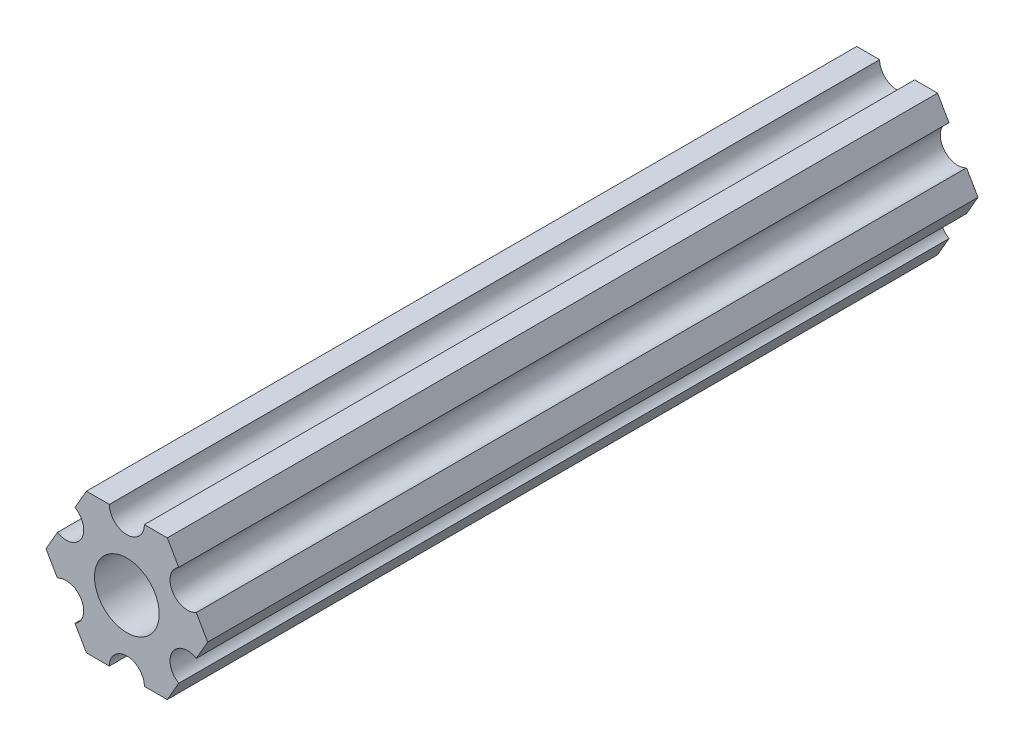
ISO-10303-21;
HEADER;
FILE_DESCRIPTION(('STEP AP214'),'2;1');
FILE_NAME('part.step','',(''),(''),'','','');
FILE_SCHEMA(('AUTOMOTIVE_DESIGN { 1 0 10303 214 1 1 1 1 }'));
ENDSEC;
DATA;
#1=APPLICATION_CONTEXT('core data for automotive mechanical design processes');
#2=APPLICATION_PROTOCOL_DEFINITION('international standard','automotive_design',2000,#1);
#3=PRODUCT_CONTEXT('',#1,'mechanical');
#4=PRODUCT('Part','Part','',(#3));
#5=PRODUCT_RELATED_PRODUCT_CATEGORY('part','',(#4));
#6=PRODUCT_DEFINITION_FORMATION('','',#4);
#7=PRODUCT_DEFINITION_CONTEXT('part definition',#1,'design');
#8=PRODUCT_DEFINITION('design','',#6,#7);
#9=PRODUCT_DEFINITION_SHAPE('','',#8);
#10=(LENGTH_UNIT() NAMED_UNIT(*) SI_UNIT(.MILLI.,.METRE.));
#11=(NAMED_UNIT(*) PLANE_ANGLE_UNIT() SI_UNIT($,.RADIAN.));
#12=(NAMED_UNIT(*) SI_UNIT($,.STERADIAN.) SOLID_ANGLE_UNIT());
#13=UNCERTAINTY_MEASURE_WITH_UNIT(LENGTH_MEASURE(1.E-05),#10,'distance_accuracy_value','');
#14=(GEOMETRIC_REPRESENTATION_CONTEXT(3) GLOBAL_UNCERTAINTY_ASSIGNED_CONTEXT((#13)) GLOBAL_UNIT_ASSIGNED_CONTEXT((#10,
#11,#12)) REPRESENTATION_CONTEXT('',''));
#15=CARTESIAN_POINT('',(0.,0.,0.));
#16=DIRECTION('',(0.,0.,1.));
#17=DIRECTION('',(1.,0.,0.));
#18=AXIS2_PLACEMENT_3D('',#15,#16,#17);
#19=CARTESIAN_POINT('',(6.29301142309098,-1.80018429024546,69.85));
#20=DIRECTION('',(-0.866025434075723,0.499999947533953,0.));
#21=DIRECTION('',(-0.499999947533953,-0.866025434075723,0.));
#22=AXIS2_PLACEMENT_3D('',#19,#20,#21);
#23=PLANE('',#22);
#24=DIRECTION('',(0.,0.,1.));
#25=VECTOR('',#24,1.);
#26=CARTESIAN_POINT('',(7.33234841870826,4.44212519169686E-07,69.85));
#27=LINE('',#26,#25);
#28=CARTESIAN_POINT('',(7.33234841870826,4.44212518961143E-07,0.));
#29=VERTEX_POINT('',#28);
#30=CARTESIAN_POINT('',(7.33234841870826,4.44212519315656E-07,69.85));
#31=VERTEX_POINT('',#30);
#32=EDGE_CURVE('E298',#29,#31,#27,.T.);
#33=ORIENTED_EDGE('',*,*,#32,.T.);
#34=DIRECTION('',(0.499999947533953,0.866025434075723,0.));
#35=VECTOR('',#34,1.);
#36=CARTESIAN_POINT('',(6.29301142309098,-1.80018429024546,69.85));
#37=LINE('',#36,#35);
#38=CARTESIAN_POINT('',(6.29301142309098,-1.80018429024546,69.85));
#39=VERTEX_POINT('',#38);
#40=EDGE_CURVE('E181',#39,#31,#37,.T.);
#41=ORIENTED_EDGE('',*,*,#40,.F.);
#42=DIRECTION('',(0.,0.,-1.));
#43=VECTOR('',#42,1.);
#44=CARTESIAN_POINT('',(6.29301142309098,-1.80018429024546,69.85));
#45=LINE('',#44,#43);
#46=CARTESIAN_POINT('',(6.29301142309098,-1.80018429024546,0.));
#47=VERTEX_POINT('',#46);
#48=EDGE_CURVE('E247',#39,#47,#45,.T.);
#49=ORIENTED_EDGE('',*,*,#48,.T.);
#50=DIRECTION('',(0.499999947533953,0.866025434075723,0.));
#51=VECTOR('',#50,1.);
#52=CARTESIAN_POINT('',(6.29301142309098,-1.80018429024546,0.));
#53=LINE('',#52,#51);
#54=EDGE_CURVE('E185',#47,#29,#53,.T.);
#55=ORIENTED_EDGE('',*,*,#54,.T.);
#56=EDGE_LOOP('',(#33,#41,#49,#55));
#57=FACE_BOUND('',#56,.T.);
#58=ADVANCED_FACE('F16',(#57),#23,.F.);
#59=CARTESIAN_POINT('',(7.33234841870826,4.44212519169686E-07,69.85));
#60=DIRECTION('',(-0.866025373493145,-0.500000052466056,0.));
#61=DIRECTION('',(0.500000052466056,-0.866025373493145,0.));
#62=AXIS2_PLACEMENT_3D('',#59,#60,#61);
#63=PLANE('',#62);
#64=DIRECTION('',(0.,0.,-1.));
#65=VECTOR('',#64,1.);
#66=CARTESIAN_POINT('',(6.29301120497139,1.80018505273895,69.85));
#67=LINE('',#66,#65);
#68=CARTESIAN_POINT('',(6.29301120497139,1.80018505273895,0.));
#69=VERTEX_POINT('',#68);
#70=CARTESIAN_POINT('',(6.29301120497139,1.80018505273895,69.85));
#71=VERTEX_POINT('',#70);
#72=EDGE_CURVE('E296',#69,#71,#67,.F.);
#73=ORIENTED_EDGE('',*,*,#72,.T.);
#74=DIRECTION('',(-0.500000052466056,0.866025373493145,0.));
#75=VECTOR('',#74,1.);
#76=CARTESIAN_POINT('',(7.33234841870826,4.44212519198905E-07,69.85));
#77=LINE('',#76,#75);
#78=EDGE_CURVE('E63',#31,#71,#77,.T.);
#79=ORIENTED_EDGE('',*,*,#78,.F.);
#80=ORIENTED_EDGE('',*,*,#32,.F.);
#81=DIRECTION('',(-0.500000052466056,0.866025373493145,0.));
#82=VECTOR('',#81,1.);
#83=CARTESIAN_POINT('',(7.33234841870826,4.44212519198905E-07,0.));
#84=LINE('',#83,#82);
#85=EDGE_CURVE('E244',#29,#69,#84,.T.);
#86=ORIENTED_EDGE('',*,*,#85,.T.);
#87=EDGE_LOOP('',(#73,#79,#80,#86));
#88=FACE_BOUND('',#87,.T.);
#89=ADVANCED_FACE('F345',(#88),#63,.F.);
#90=CARTESIAN_POINT('',(5.49926112168156,3.17500033315933,69.85));
#91=DIRECTION('',(0.,0.,-1.));
#92=DIRECTION('',(-1.,0.,0.));
#93=AXIS2_PLACEMENT_3D('',#90,#91,#92);
#94=CYLINDRICAL_SURFACE('',#93,1.5875);
#95=CARTESIAN_POINT('',(5.49926112168156,3.17500033315933,69.85));
#96=DIRECTION('',(0.,0.,-1.));
#97=DIRECTION('',(-1.,0.,0.));
#98=AXIS2_PLACEMENT_3D('',#95,#96,#97);
#99=CIRCLE('',#98,1.5875);
#100=CARTESIAN_POINT('',(4.70551103839172,4.54981561357972,69.85));
#101=VERTEX_POINT('',#100);
#102=EDGE_CURVE('E55',#71,#101,#99,.T.);
#103=ORIENTED_EDGE('',*,*,#102,.F.);
#104=ORIENTED_EDGE('',*,*,#72,.F.);
#105=CARTESIAN_POINT('',(5.49926112168156,3.17500033315933,0.));
#106=DIRECTION('',(0.,0.,-1.));
#107=DIRECTION('',(-1.,0.,0.));
#108=AXIS2_PLACEMENT_3D('',#105,#106,#107);
#109=CIRCLE('',#108,1.5875);
#110=CARTESIAN_POINT('',(4.70551103839172,4.54981561357972,0.));
#111=VERTEX_POINT('',#110);
#112=EDGE_CURVE('E19',#69,#111,#109,.T.);
#113=ORIENTED_EDGE('',*,*,#112,.T.);
#114=DIRECTION('',(0.,0.,1.));
#115=VECTOR('',#114,1.);
#116=CARTESIAN_POINT('',(4.70551103839172,4.54981561357972,69.85));
#117=LINE('',#116,#115);
#118=EDGE_CURVE('E292',#111,#101,#117,.T.);
#119=ORIENTED_EDGE('',*,*,#118,.T.);
#120=EDGE_LOOP('',(#103,#104,#113,#119));
#121=FACE_BOUND('',#120,.T.);
#122=ADVANCED_FACE('F343',(#121),#94,.F.);
#123=CARTESIAN_POINT('',(4.70551103839172,4.54981561357972,69.85));
#124=DIRECTION('',(-0.866025373493151,-0.500000052466046,0.));
#125=DIRECTION('',(0.500000052466046,-0.866025373493151,0.));
#126=AXIS2_PLACEMENT_3D('',#123,#124,#125);
#127=PLANE('',#126);
#128=DIRECTION('',(0.,0.,1.));
#129=VECTOR('',#128,1.);
#130=CARTESIAN_POINT('',(3.66617382465481,6.35000022210627,69.85));
#131=LINE('',#130,#129);
#132=CARTESIAN_POINT('',(3.66617382465481,6.35000022210627,0.));
#133=VERTEX_POINT('',#132);
#134=CARTESIAN_POINT('',(3.66617382465481,6.35000022210627,69.85));
#135=VERTEX_POINT('',#134);
#136=EDGE_CURVE('E289',#133,#135,#131,.T.);
#137=ORIENTED_EDGE('',*,*,#136,.T.);
#138=DIRECTION('',(-0.500000052466046,0.866025373493151,0.));
#139=VECTOR('',#138,1.);
#140=CARTESIAN_POINT('',(4.70551103839172,4.54981561357972,69.85));
#141=LINE('',#140,#139);
#142=EDGE_CURVE('E174',#101,#135,#141,.T.);
#143=ORIENTED_EDGE('',*,*,#142,.F.);
#144=ORIENTED_EDGE('',*,*,#118,.F.);
#145=DIRECTION('',(-0.500000052466046,0.866025373493151,0.));
#146=VECTOR('',#145,1.);
#147=CARTESIAN_POINT('',(4.70551103839172,4.54981561357972,0.));
#148=LINE('',#147,#146);
#149=EDGE_CURVE('E237',#111,#133,#148,.T.);
#150=ORIENTED_EDGE('',*,*,#149,.T.);
#151=EDGE_LOOP('',(#137,#143,#144,#150));
#152=FACE_BOUND('',#151,.T.);
#153=ADVANCED_FACE('F336',(#152),#127,.F.);
#154=CARTESIAN_POINT('',(3.66617382465481,6.35000022210627,69.85));
#155=DIRECTION('',(6.05825850611185E-08,-0.999999999999998,0.));
#156=DIRECTION('',(0.999999999999998,6.05825850611185E-08,0.));
#157=AXIS2_PLACEMENT_3D('',#154,#155,#156);
#158=PLANE('',#157);
#159=DIRECTION('',(0.,0.,-1.));
#160=VECTOR('',#159,1.);
#161=CARTESIAN_POINT('',(1.58749961530074,6.35000009617482,69.85));
#162=LINE('',#161,#160);
#163=CARTESIAN_POINT('',(1.58749961530073,6.35000015914054,0.));
#164=VERTEX_POINT('',#163);
#165=CARTESIAN_POINT('',(1.58749961530073,6.35000015914054,69.85));
#166=VERTEX_POINT('',#165);
#167=EDGE_CURVE('E287',#164,#166,#162,.F.);
#168=ORIENTED_EDGE('',*,*,#167,.T.);
#169=DIRECTION('',(1.,0.,0.));
#170=VECTOR('',#169,1.);
#171=CARTESIAN_POINT('',(5.49926112168156,6.35000022210627,69.85));
#172=LINE('',#171,#170);
#173=EDGE_CURVE('E144',#135,#166,#172,.F.);
#174=ORIENTED_EDGE('',*,*,#173,.F.);
#175=ORIENTED_EDGE('',*,*,#136,.F.);
#176=DIRECTION('',(1.,0.,0.));
#177=VECTOR('',#176,1.);
#178=CARTESIAN_POINT('',(5.49926112168156,6.35000022210627,0.));
#179=LINE('',#178,#177);
#180=EDGE_CURVE('E234',#133,#164,#179,.F.);
#181=ORIENTED_EDGE('',*,*,#180,.T.);
#182=EDGE_LOOP('',(#168,#174,#175,#181));
#183=FACE_BOUND('',#182,.T.);
#184=ADVANCED_FACE('F333',(#183),#158,.F.);
#185=CARTESIAN_POINT('',(-3.84699260060323E-07,6.35,69.85));
#186=DIRECTION('',(0.,0.,-1.));
#187=DIRECTION('',(-1.,0.,0.));
#188=AXIS2_PLACEMENT_3D('',#185,#186,#187);
#189=CYLINDRICAL_SURFACE('',#188,1.5875);
#190=DIRECTION('',(0.,0.,1.));
#191=VECTOR('',#190,1.);
#192=CARTESIAN_POINT('',(-1.58750038469926,6.34999990382518,69.85));
#193=LINE('',#192,#191);
#194=CARTESIAN_POINT('',(-1.58750038469926,6.34999990382518,0.));
#195=VERTEX_POINT('',#194);
#196=CARTESIAN_POINT('',(-1.58750038469926,6.34999990382518,69.85));
#197=VERTEX_POINT('',#196);
#198=EDGE_CURVE('E103',#195,#197,#193,.T.);
#199=ORIENTED_EDGE('',*,*,#198,.T.);
#200=CARTESIAN_POINT('',(-3.84699260060323E-07,6.35,69.85));
#201=DIRECTION('',(0.,0.,-1.));
#202=DIRECTION('',(-1.,0.,0.));
#203=AXIS2_PLACEMENT_3D('',#200,#201,#202);
#204=CIRCLE('',#203,1.5875);
#205=EDGE_CURVE('E148',#166,#197,#204,.T.);
#206=ORIENTED_EDGE('',*,*,#205,.F.);
#207=ORIENTED_EDGE('',*,*,#167,.F.);
#208=CARTESIAN_POINT('',(-3.84699260060323E-07,6.35,0.));
#209=DIRECTION('',(0.,0.,-1.));
#210=DIRECTION('',(-1.,0.,0.));
#211=AXIS2_PLACEMENT_3D('',#208,#209,#210);
#212=CIRCLE('',#211,1.5875);
#213=EDGE_CURVE('E231',#164,#195,#212,.T.);
#214=ORIENTED_EDGE('',*,*,#213,.T.);
#215=EDGE_LOOP('',(#199,#206,#207,#214));
#216=FACE_BOUND('',#215,.T.);
#217=ADVANCED_FACE('F327',(#216),#189,.F.);
#218=CARTESIAN_POINT('',(-1.58750038469926,6.34999990382518,69.85));
#219=DIRECTION('',(6.05825963273174E-08,-0.999999999999998,0.));
#220=DIRECTION('',(0.999999999999998,6.05825963273174E-08,0.));
#221=AXIS2_PLACEMENT_3D('',#218,#219,#220);
#222=PLANE('',#221);
#223=DIRECTION('',(0.,0.,1.));
#224=VECTOR('',#223,1.);
#225=CARTESIAN_POINT('',(-3.66617459405349,6.3499997778937,69.85));
#226=LINE('',#225,#224);
#227=CARTESIAN_POINT('',(-3.66617454558244,6.34999986184803,0.));
#228=VERTEX_POINT('',#227);
#229=CARTESIAN_POINT('',(-3.66617454558244,6.34999986184803,69.85));
#230=VERTEX_POINT('',#229);
#231=EDGE_CURVE('E111',#228,#230,#226,.T.);
#232=ORIENTED_EDGE('',*,*,#231,.T.);
#233=DIRECTION('',(1.,0.,0.));
#234=VECTOR('',#233,1.);
#235=CARTESIAN_POINT('',(5.49926112168156,6.34999990382518,69.85));
#236=LINE('',#235,#234);
#237=EDGE_CURVE('E149',#197,#230,#236,.F.);
#238=ORIENTED_EDGE('',*,*,#237,.F.);
#239=ORIENTED_EDGE('',*,*,#198,.F.);
#240=DIRECTION('',(1.,0.,0.));
#241=VECTOR('',#240,1.);
#242=CARTESIAN_POINT('',(5.49926112168156,6.34999990382518,0.));
#243=LINE('',#242,#241);
#244=EDGE_CURVE('E156',#195,#228,#243,.F.);
#245=ORIENTED_EDGE('',*,*,#244,.T.);
#246=EDGE_LOOP('',(#232,#238,#239,#245));
#247=FACE_BOUND('',#246,.T.);
#248=ADVANCED_FACE('F155',(#247),#222,.F.);
#249=CARTESIAN_POINT('',(-3.66617459405349,6.3499997778937,69.85));
#250=DIRECTION('',(0.866025434075729,-0.499999947533942,0.));
#251=DIRECTION('',(0.499999947533942,0.866025434075729,0.));
#252=AXIS2_PLACEMENT_3D('',#249,#250,#251);
#253=PLANE('',#252);
#254=DIRECTION('',(0.,0.,-1.));
#255=VECTOR('',#254,1.);
#256=CARTESIAN_POINT('',(-4.70551158967065,4.54981504343587,69.85));
#257=LINE('',#256,#255);
#258=CARTESIAN_POINT('',(-4.70551158967065,4.54981504343587,0.));
#259=VERTEX_POINT('',#258);
#260=CARTESIAN_POINT('',(-4.70551158967065,4.54981504343587,69.85));
#261=VERTEX_POINT('',#260);
#262=EDGE_CURVE('E157',#259,#261,#257,.F.);
#263=ORIENTED_EDGE('',*,*,#262,.T.);
#264=DIRECTION('',(-0.499999947533943,-0.866025434075729,0.));
#265=VECTOR('',#264,1.);
#266=CARTESIAN_POINT('',(-3.66617459405349,6.3499997778937,69.85));
#267=LINE('',#266,#265);
#268=EDGE_CURVE('E152',#230,#261,#267,.T.);
#269=ORIENTED_EDGE('',*,*,#268,.F.);
#270=ORIENTED_EDGE('',*,*,#231,.F.);
#271=DIRECTION('',(-0.499999947533943,-0.866025434075729,0.));
#272=VECTOR('',#271,1.);
#273=CARTESIAN_POINT('',(-3.66617459405349,6.3499997778937,0.));
#274=LINE('',#273,#272);
#275=EDGE_CURVE('E226',#228,#259,#274,.T.);
#276=ORIENTED_EDGE('',*,*,#275,.T.);
#277=EDGE_LOOP('',(#263,#269,#270,#276));
#278=FACE_BOUND('',#277,.T.);
#279=ADVANCED_FACE('F159',(#278),#253,.F.);
#280=CARTESIAN_POINT('',(-5.49926150638082,3.17499966684067,69.85));
#281=DIRECTION('',(0.,0.,-1.));
#282=DIRECTION('',(-1.,0.,0.));
#283=AXIS2_PLACEMENT_3D('',#280,#281,#282);
#284=CYLINDRICAL_SURFACE('',#283,1.5875);
#285=DIRECTION('',(0.,0.,1.));
#286=VECTOR('',#285,1.);
#287=CARTESIAN_POINT('',(-6.29301142309098,1.80018429024547,69.85));
#288=LINE('',#287,#286);
#289=CARTESIAN_POINT('',(-6.29301142309098,1.80018429024547,0.));
#290=VERTEX_POINT('',#289);
#291=CARTESIAN_POINT('',(-6.29301142309098,1.80018429024547,69.85));
#292=VERTEX_POINT('',#291);
#293=EDGE_CURVE('E278',#290,#292,#288,.T.);
#294=ORIENTED_EDGE('',*,*,#293,.T.);
#295=CARTESIAN_POINT('',(-5.49926150638082,3.17499966684067,69.85));
#296=DIRECTION('',(0.,0.,-1.));
#297=DIRECTION('',(-1.,0.,0.));
#298=AXIS2_PLACEMENT_3D('',#295,#296,#297);
#299=CIRCLE('',#298,1.5875);
#300=EDGE_CURVE('E161',#261,#292,#299,.T.);
#301=ORIENTED_EDGE('',*,*,#300,.F.);
#302=ORIENTED_EDGE('',*,*,#262,.F.);
#303=CARTESIAN_POINT('',(-5.49926150638082,3.17499966684067,0.));
#304=DIRECTION('',(0.,0.,-1.));
#305=DIRECTION('',(-1.,0.,0.));
#306=AXIS2_PLACEMENT_3D('',#303,#304,#305);
#307=CIRCLE('',#306,1.5875);
#308=EDGE_CURVE('E223',#259,#290,#307,.T.);
#309=ORIENTED_EDGE('',*,*,#308,.T.);
#310=EDGE_LOOP('',(#294,#301,#302,#309));
#311=FACE_BOUND('',#310,.T.);
#312=ADVANCED_FACE('F408',(#311),#284,.F.);
#313=CARTESIAN_POINT('',(-6.29301142309098,1.80018429024547,69.85));
#314=DIRECTION('',(0.866025434075724,-0.499999947533951,0.));
#315=DIRECTION('',(0.499999947533951,0.866025434075724,0.));
#316=AXIS2_PLACEMENT_3D('',#313,#314,#315);
#317=PLANE('',#316);
#318=DIRECTION('',(0.,0.,1.));
#319=VECTOR('',#318,1.);
#320=CARTESIAN_POINT('',(-7.33234841870826,-4.44212523790841E-07,69.85));
#321=LINE('',#320,#319);
#322=CARTESIAN_POINT('',(-7.33234841870826,-4.44212524036367E-07,0.));
#323=VERTEX_POINT('',#322);
#324=CARTESIAN_POINT('',(-7.33234841870826,-4.44212524036367E-07,69.85));
#325=VERTEX_POINT('',#324);
#326=EDGE_CURVE('E275',#323,#325,#321,.T.);
#327=ORIENTED_EDGE('',*,*,#326,.T.);
#328=DIRECTION('',(-0.499999947533952,-0.866025434075724,0.));
#329=VECTOR('',#328,1.);
#330=CARTESIAN_POINT('',(-6.29301142309098,1.80018429024547,69.85));
#331=LINE('',#330,#329);
#332=EDGE_CURVE('E163',#292,#325,#331,.T.);
#333=ORIENTED_EDGE('',*,*,#332,.F.);
#334=ORIENTED_EDGE('',*,*,#293,.F.);
#335=DIRECTION('',(-0.499999947533952,-0.866025434075724,0.));
#336=VECTOR('',#335,1.);
#337=CARTESIAN_POINT('',(-6.29301142309098,1.80018429024547,0.));
#338=LINE('',#337,#336);
#339=EDGE_CURVE('E218',#290,#323,#338,.T.);
#340=ORIENTED_EDGE('',*,*,#339,.T.);
#341=EDGE_LOOP('',(#327,#333,#334,#340));
#342=FACE_BOUND('',#341,.T.);
#343=ADVANCED_FACE('F376',(#342),#317,.F.);
#344=CARTESIAN_POINT('',(-7.33234841870826,-4.44212523790841E-07,69.85));
#345=DIRECTION('',(0.866025373493151,0.500000052466045,0.));
#346=DIRECTION('',(-0.500000052466045,0.866025373493151,0.));
#347=AXIS2_PLACEMENT_3D('',#344,#345,#346);
#348=PLANE('',#347);
#349=DIRECTION('',(0.,0.,-1.));
#350=VECTOR('',#349,1.);
#351=CARTESIAN_POINT('',(-6.29301120497141,-1.80018505273896,69.85));
#352=LINE('',#351,#350);
#353=CARTESIAN_POINT('',(-6.29301120497141,-1.80018505273896,0.));
#354=VERTEX_POINT('',#353);
#355=CARTESIAN_POINT('',(-6.29301120497141,-1.80018505273896,69.85));
#356=VERTEX_POINT('',#355);
#357=EDGE_CURVE('E272',#354,#356,#352,.F.);
#358=ORIENTED_EDGE('',*,*,#357,.T.);
#359=DIRECTION('',(0.500000052466045,-0.866025373493151,0.));
#360=VECTOR('',#359,1.);
#361=CARTESIAN_POINT('',(-7.33234841870826,-4.44212523969395E-07,69.85));
#362=LINE('',#361,#360);
#363=EDGE_CURVE('E313',#325,#356,#362,.T.);
#364=ORIENTED_EDGE('',*,*,#363,.F.);
#365=ORIENTED_EDGE('',*,*,#326,.F.);
#366=DIRECTION('',(0.500000052466045,-0.866025373493151,0.));
#367=VECTOR('',#366,1.);
#368=CARTESIAN_POINT('',(-7.33234841870826,-4.44212523969395E-07,0.));
#369=LINE('',#368,#367);
#370=EDGE_CURVE('E215',#323,#354,#369,.T.);
#371=ORIENTED_EDGE('',*,*,#370,.T.);
#372=EDGE_LOOP('',(#358,#364,#365,#371));
#373=FACE_BOUND('',#372,.T.);
#374=ADVANCED_FACE('F380',(#373),#348,.F.);
#375=CARTESIAN_POINT('',(-5.49926112168156,-3.17500033315934,69.85));
#376=DIRECTION('',(0.,0.,-1.));
#377=DIRECTION('',(-1.,0.,0.));
#378=AXIS2_PLACEMENT_3D('',#375,#376,#377);
#379=CYLINDRICAL_SURFACE('',#378,1.5875);
#380=DIRECTION('',(0.,0.,1.));
#381=VECTOR('',#380,1.);
#382=CARTESIAN_POINT('',(-4.70551103839172,-4.54981561357972,69.85));
#383=LINE('',#382,#381);
#384=CARTESIAN_POINT('',(-4.70551103839172,-4.54981561357972,0.));
#385=VERTEX_POINT('',#384);
#386=CARTESIAN_POINT('',(-4.70551103839172,-4.54981561357972,69.85));
#387=VERTEX_POINT('',#386);
#388=EDGE_CURVE('E267',#385,#387,#383,.T.);
#389=ORIENTED_EDGE('',*,*,#388,.T.);
#390=CARTESIAN_POINT('',(-5.49926112168156,-3.17500033315934,69.85));
#391=DIRECTION('',(0.,0.,-1.));
#392=DIRECTION('',(-1.,0.,0.));
#393=AXIS2_PLACEMENT_3D('',#390,#391,#392);
#394=CIRCLE('',#393,1.5875);
#395=EDGE_CURVE('E311',#356,#387,#394,.T.);
#396=ORIENTED_EDGE('',*,*,#395,.F.);
#397=ORIENTED_EDGE('',*,*,#357,.F.);
#398=CARTESIAN_POINT('',(-5.49926112168156,-3.17500033315934,0.));
#399=DIRECTION('',(0.,0.,-1.));
#400=DIRECTION('',(-1.,0.,0.));
#401=AXIS2_PLACEMENT_3D('',#398,#399,#400);
#402=CIRCLE('',#401,1.5875);
#403=EDGE_CURVE('E212',#354,#385,#402,.T.);
#404=ORIENTED_EDGE('',*,*,#403,.T.);
#405=EDGE_LOOP('',(#389,#396,#397,#404));
#406=FACE_BOUND('',#405,.T.);
#407=ADVANCED_FACE('F384',(#406),#379,.F.);
#408=CARTESIAN_POINT('',(-4.70551103839172,-4.54981561357972,69.85));
#409=DIRECTION('',(0.866025373493151,0.500000052466045,0.));
#410=DIRECTION('',(-0.500000052466045,0.866025373493151,0.));
#411=AXIS2_PLACEMENT_3D('',#408,#409,#410);
#412=PLANE('',#411);
#413=DIRECTION('',(0.,0.,1.));
#414=VECTOR('',#413,1.);
#415=CARTESIAN_POINT('',(-3.66617382465481,-6.35000022210628,69.85));
#416=LINE('',#415,#414);
#417=CARTESIAN_POINT('',(-3.6661738246548,-6.35000022210628,0.));
#418=VERTEX_POINT('',#417);
#419=CARTESIAN_POINT('',(-3.6661738246548,-6.35000022210628,69.85));
#420=VERTEX_POINT('',#419);
#421=EDGE_CURVE('E264',#418,#420,#416,.T.);
#422=ORIENTED_EDGE('',*,*,#421,.T.);
#423=DIRECTION('',(0.500000052466045,-0.866025373493151,0.));
#424=VECTOR('',#423,1.);
#425=CARTESIAN_POINT('',(-4.70551103839172,-4.54981561357972,69.85));
#426=LINE('',#425,#424);
#427=EDGE_CURVE('E312',#387,#420,#426,.T.);
#428=ORIENTED_EDGE('',*,*,#427,.F.);
#429=ORIENTED_EDGE('',*,*,#388,.F.);
#430=DIRECTION('',(0.500000052466045,-0.866025373493151,0.));
#431=VECTOR('',#430,1.);
#432=CARTESIAN_POINT('',(-4.70551103839172,-4.54981561357972,0.));
#433=LINE('',#432,#431);
#434=EDGE_CURVE('E207',#385,#418,#433,.T.);
#435=ORIENTED_EDGE('',*,*,#434,.T.);
#436=EDGE_LOOP('',(#422,#428,#429,#435));
#437=FACE_BOUND('',#436,.T.);
#438=ADVANCED_FACE('F390',(#437),#412,.F.);
#439=CARTESIAN_POINT('',(-3.66617382465481,-6.35000022210628,69.85));
#440=DIRECTION('',(-6.05825854783851E-08,0.999999999999998,0.));
#441=DIRECTION('',(-0.999999999999998,-6.05825854783851E-08,0.));
#442=AXIS2_PLACEMENT_3D('',#439,#440,#441);
#443=PLANE('',#442);
#444=DIRECTION('',(0.,0.,-1.));
#445=VECTOR('',#444,1.);
#446=CARTESIAN_POINT('',(-1.58749961530074,-6.35,69.85));
#447=LINE('',#446,#445);
#448=CARTESIAN_POINT('',(-1.58749961530073,-6.35000011105314,0.));
#449=VERTEX_POINT('',#448);
#450=CARTESIAN_POINT('',(-1.58749961530073,-6.35000011105314,69.85));
#451=VERTEX_POINT('',#450);
#452=EDGE_CURVE('E261',#449,#451,#447,.F.);
#453=ORIENTED_EDGE('',*,*,#452,.T.);
#454=DIRECTION('',(1.,0.,0.));
#455=VECTOR('',#454,1.);
#456=CARTESIAN_POINT('',(5.49926112168156,-6.35000022210628,69.85));
#457=LINE('',#456,#455);
#458=EDGE_CURVE('E310',#420,#451,#457,.T.);
#459=ORIENTED_EDGE('',*,*,#458,.F.);
#460=ORIENTED_EDGE('',*,*,#421,.F.);
#461=DIRECTION('',(1.,0.,0.));
#462=VECTOR('',#461,1.);
#463=CARTESIAN_POINT('',(5.49926112168156,-6.35000022210628,0.));
#464=LINE('',#463,#462);
#465=EDGE_CURVE('E204',#418,#449,#464,.T.);
#466=ORIENTED_EDGE('',*,*,#465,.T.);
#467=EDGE_LOOP('',(#453,#459,#460,#466));
#468=FACE_BOUND('',#467,.T.);
#469=ADVANCED_FACE('F394',(#468),#443,.F.);
#470=CARTESIAN_POINT('',(3.8469926204343E-07,-6.35,69.85));
#471=DIRECTION('',(0.,0.,-1.));
#472=DIRECTION('',(-1.,0.,0.));
#473=AXIS2_PLACEMENT_3D('',#470,#471,#472);
#474=CYLINDRICAL_SURFACE('',#473,1.5875);
#475=DIRECTION('',(0.,0.,1.));
#476=VECTOR('',#475,1.);
#477=CARTESIAN_POINT('',(1.58750038469926,-6.34999990382518,69.85));
#478=LINE('',#477,#476);
#479=CARTESIAN_POINT('',(1.58750038469926,-6.34999990382518,0.));
#480=VERTEX_POINT('',#479);
#481=CARTESIAN_POINT('',(1.58750038469926,-6.34999990382518,69.85));
#482=VERTEX_POINT('',#481);
#483=EDGE_CURVE('E256',#480,#482,#478,.T.);
#484=ORIENTED_EDGE('',*,*,#483,.T.);
#485=CARTESIAN_POINT('',(3.8469926204343E-07,-6.35,69.85));
#486=DIRECTION('',(0.,0.,-1.));
#487=DIRECTION('',(-1.,0.,0.));
#488=AXIS2_PLACEMENT_3D('',#485,#486,#487);
#489=CIRCLE('',#488,1.5875);
#490=EDGE_CURVE('E307',#451,#482,#489,.T.);
#491=ORIENTED_EDGE('',*,*,#490,.F.);
#492=ORIENTED_EDGE('',*,*,#452,.F.);
#493=CARTESIAN_POINT('',(3.8469926204343E-07,-6.35,0.));
#494=DIRECTION('',(0.,0.,-1.));
#495=DIRECTION('',(-1.,0.,0.));
#496=AXIS2_PLACEMENT_3D('',#493,#494,#495);
#497=CIRCLE('',#496,1.5875);
#498=EDGE_CURVE('E201',#449,#480,#497,.T.);
#499=ORIENTED_EDGE('',*,*,#498,.T.);
#500=EDGE_LOOP('',(#484,#491,#492,#499));
#501=FACE_BOUND('',#500,.T.);
#502=ADVANCED_FACE('F398',(#501),#474,.F.);
#503=CARTESIAN_POINT('',(1.58750038469926,-6.34999990382518,69.85));
#504=DIRECTION('',(-6.05825721258438E-08,0.999999999999998,0.));
#505=DIRECTION('',(-0.999999999999998,-6.05825721258438E-08,0.));
#506=AXIS2_PLACEMENT_3D('',#503,#504,#505);
#507=PLANE('',#506);
#508=DIRECTION('',(0.,0.,1.));
#509=VECTOR('',#508,1.);
#510=CARTESIAN_POINT('',(3.66617459405346,-6.34999977789375,69.85));
#511=LINE('',#510,#509);
#512=CARTESIAN_POINT('',(3.66617454558244,-6.34999986184804,0.));
#513=VERTEX_POINT('',#512);
#514=CARTESIAN_POINT('',(3.66617454558244,-6.34999986184804,69.85));
#515=VERTEX_POINT('',#514);
#516=EDGE_CURVE('E253',#513,#515,#511,.T.);
#517=ORIENTED_EDGE('',*,*,#516,.T.);
#518=DIRECTION('',(1.,0.,0.));
#519=VECTOR('',#518,1.);
#520=CARTESIAN_POINT('',(5.49926112168156,-6.34999990382518,69.85));
#521=LINE('',#520,#519);
#522=EDGE_CURVE('E309',#482,#515,#521,.T.);
#523=ORIENTED_EDGE('',*,*,#522,.F.);
#524=ORIENTED_EDGE('',*,*,#483,.F.);
#525=DIRECTION('',(1.,0.,0.));
#526=VECTOR('',#525,1.);
#527=CARTESIAN_POINT('',(5.49926112168156,-6.34999990382518,0.));
#528=LINE('',#527,#526);
#529=EDGE_CURVE('E196',#480,#513,#528,.T.);
#530=ORIENTED_EDGE('',*,*,#529,.T.);
#531=EDGE_LOOP('',(#517,#523,#524,#530));
#532=FACE_BOUND('',#531,.T.);
#533=ADVANCED_FACE('F401',(#532),#507,.F.);
#534=CARTESIAN_POINT('',(3.66617459405346,-6.34999977789375,69.85));
#535=DIRECTION('',(-0.86602543407573,0.499999947533941,0.));
#536=DIRECTION('',(-0.499999947533941,-0.86602543407573,0.));
#537=AXIS2_PLACEMENT_3D('',#534,#535,#536);
#538=PLANE('',#537);
#539=DIRECTION('',(0.,0.,1.));
#540=VECTOR('',#539,1.);
#541=CARTESIAN_POINT('',(4.70551158967065,-4.54981504343587,69.85));
#542=LINE('',#541,#540);
#543=CARTESIAN_POINT('',(4.70551158967065,-4.54981504343587,69.85));
#544=VERTEX_POINT('',#543);
#545=CARTESIAN_POINT('',(4.70551158967065,-4.54981504343587,0.));
#546=VERTEX_POINT('',#545);
#547=EDGE_CURVE('E251',#544,#546,#542,.F.);
#548=ORIENTED_EDGE('',*,*,#547,.F.);
#549=DIRECTION('',(0.49999994753394,0.86602543407573,0.));
#550=VECTOR('',#549,1.);
#551=CARTESIAN_POINT('',(3.66617459405346,-6.34999977789376,69.85));
#552=LINE('',#551,#550);
#553=EDGE_CURVE('E306',#515,#544,#552,.T.);
#554=ORIENTED_EDGE('',*,*,#553,.F.);
#555=ORIENTED_EDGE('',*,*,#516,.F.);
#556=DIRECTION('',(0.49999994753394,0.86602543407573,0.));
#557=VECTOR('',#556,1.);
#558=CARTESIAN_POINT('',(3.66617459405346,-6.34999977789376,0.));
#559=LINE('',#558,#557);
#560=EDGE_CURVE('E193',#513,#546,#559,.T.);
#561=ORIENTED_EDGE('',*,*,#560,.T.);
#562=EDGE_LOOP('',(#548,#554,#555,#561));
#563=FACE_BOUND('',#562,.T.);
#564=ADVANCED_FACE('F403',(#563),#538,.F.);
#565=CARTESIAN_POINT('',(5.49926150638082,-3.17499966684067,69.85));
#566=DIRECTION('',(0.,0.,-1.));
#567=DIRECTION('',(-1.,0.,0.));
#568=AXIS2_PLACEMENT_3D('',#565,#566,#567);
#569=CYLINDRICAL_SURFACE('',#568,1.58750000000001);
#570=CARTESIAN_POINT('',(5.49926150638082,-3.17499966684067,69.85));
#571=DIRECTION('',(0.,0.,-1.));
#572=DIRECTION('',(-1.,0.,0.));
#573=AXIS2_PLACEMENT_3D('',#570,#571,#572);
#574=CIRCLE('',#573,1.58750000000001);
#575=EDGE_CURVE('E34',#544,#39,#574,.T.);
#576=ORIENTED_EDGE('',*,*,#575,.F.);
#577=ORIENTED_EDGE('',*,*,#547,.T.);
#578=CARTESIAN_POINT('',(5.49926150638082,-3.17499966684067,0.));
#579=DIRECTION('',(0.,0.,-1.));
#580=DIRECTION('',(-1.,0.,0.));
#581=AXIS2_PLACEMENT_3D('',#578,#579,#580);
#582=CIRCLE('',#581,1.58750000000001);
#583=EDGE_CURVE('E190',#546,#47,#582,.T.);
#584=ORIENTED_EDGE('',*,*,#583,.T.);
#585=ORIENTED_EDGE('',*,*,#48,.F.);
#586=EDGE_LOOP('',(#576,#577,#584,#585));
#587=FACE_BOUND('',#586,.T.);
#588=ADVANCED_FACE('F349',(#587),#569,.F.);
#589=CARTESIAN_POINT('',(5.49926112168156,3.17500033315933,0.));
#590=DIRECTION('',(0.,0.,1.));
#591=DIRECTION('',(1.,0.,0.));
#592=AXIS2_PLACEMENT_3D('',#589,#590,#591);
#593=PLANE('',#592);
#594=CARTESIAN_POINT('',(0.,0.,0.));
#595=DIRECTION('',(0.,0.,-1.));
#596=DIRECTION('',(-1.,0.,0.));
#597=AXIS2_PLACEMENT_3D('',#594,#595,#596);
#598=CIRCLE('',#597,2.9337);
#599=CARTESIAN_POINT('',(-2.9337,0.,0.));
#600=VERTEX_POINT('',#599);
#601=EDGE_CURVE('E25',#600,#600,#598,.F.);
#602=ORIENTED_EDGE('',*,*,#601,.T.);
#603=EDGE_LOOP('',(#602));
#604=FACE_BOUND('',#603,.T.);
#605=ORIENTED_EDGE('',*,*,#583,.F.);
#606=ORIENTED_EDGE('',*,*,#560,.F.);
#607=ORIENTED_EDGE('',*,*,#529,.F.);
#608=ORIENTED_EDGE('',*,*,#498,.F.);
#609=ORIENTED_EDGE('',*,*,#465,.F.);
#610=ORIENTED_EDGE('',*,*,#434,.F.);
#611=ORIENTED_EDGE('',*,*,#403,.F.);
#612=ORIENTED_EDGE('',*,*,#370,.F.);
#613=ORIENTED_EDGE('',*,*,#339,.F.);
#614=ORIENTED_EDGE('',*,*,#308,.F.);
#615=ORIENTED_EDGE('',*,*,#275,.F.);
#616=ORIENTED_EDGE('',*,*,#244,.F.);
#617=ORIENTED_EDGE('',*,*,#213,.F.);
#618=ORIENTED_EDGE('',*,*,#180,.F.);
#619=ORIENTED_EDGE('',*,*,#149,.F.);
#620=ORIENTED_EDGE('',*,*,#112,.F.);
#621=ORIENTED_EDGE('',*,*,#85,.F.);
#622=ORIENTED_EDGE('',*,*,#54,.F.);
#623=EDGE_LOOP('',(#605,#606,#607,#608,#609,#610,#611,#612,#613,#614,#615,#616,#617,#618,#619,
#620,#621,#622));
#624=FACE_BOUND('',#623,.T.);
#625=ADVANCED_FACE('F330',(#604,#624),#593,.F.);
#626=CARTESIAN_POINT('',(5.49926112168156,3.17500033315933,69.85));
#627=DIRECTION('',(0.,0.,1.));
#628=DIRECTION('',(1.,0.,0.));
#629=AXIS2_PLACEMENT_3D('',#626,#627,#628);
#630=PLANE('',#629);
#631=CARTESIAN_POINT('',(0.,0.,69.85));
#632=DIRECTION('',(0.,0.,-1.));
#633=DIRECTION('',(-1.,0.,0.));
#634=AXIS2_PLACEMENT_3D('',#631,#632,#633);
#635=CIRCLE('',#634,2.9337);
#636=CARTESIAN_POINT('',(-2.9337,0.,69.85));
#637=VERTEX_POINT('',#636);
#638=EDGE_CURVE('E10',#637,#637,#635,.T.);
#639=ORIENTED_EDGE('',*,*,#638,.T.);
#640=EDGE_LOOP('',(#639));
#641=FACE_BOUND('',#640,.T.);
#642=ORIENTED_EDGE('',*,*,#553,.T.);
#643=ORIENTED_EDGE('',*,*,#575,.T.);
#644=ORIENTED_EDGE('',*,*,#40,.T.);
#645=ORIENTED_EDGE('',*,*,#78,.T.);
#646=ORIENTED_EDGE('',*,*,#102,.T.);
#647=ORIENTED_EDGE('',*,*,#142,.T.);
#648=ORIENTED_EDGE('',*,*,#173,.T.);
#649=ORIENTED_EDGE('',*,*,#205,.T.);
#650=ORIENTED_EDGE('',*,*,#237,.T.);
#651=ORIENTED_EDGE('',*,*,#268,.T.);
#652=ORIENTED_EDGE('',*,*,#300,.T.);
#653=ORIENTED_EDGE('',*,*,#332,.T.);
#654=ORIENTED_EDGE('',*,*,#363,.T.);
#655=ORIENTED_EDGE('',*,*,#395,.T.);
#656=ORIENTED_EDGE('',*,*,#427,.T.);
#657=ORIENTED_EDGE('',*,*,#458,.T.);
#658=ORIENTED_EDGE('',*,*,#490,.T.);
#659=ORIENTED_EDGE('',*,*,#522,.T.);
#660=EDGE_LOOP('',(#642,#643,#644,#645,#646,#647,#648,#649,#650,#651,#652,#653,#654,#655,#656,
#657,#658,#659));
#661=FACE_BOUND('',#660,.T.);
#662=ADVANCED_FACE('F151',(#641,#661),#630,.T.);
#663=CARTESIAN_POINT('',(0.,0.,69.85));
#664=DIRECTION('',(0.,0.,-1.));
#665=DIRECTION('',(-1.,0.,0.));
#666=AXIS2_PLACEMENT_3D('',#663,#664,#665);
#667=CYLINDRICAL_SURFACE('',#666,2.9337);
#668=ORIENTED_EDGE('',*,*,#601,.F.);
#669=EDGE_LOOP('',(#668));
#670=FACE_BOUND('',#669,.T.);
#671=ORIENTED_EDGE('',*,*,#638,.F.);
#672=EDGE_LOOP('',(#671));
#673=FACE_BOUND('',#672,.T.);
#674=ADVANCED_FACE('F418',(#670,#673),#667,.F.);
#675=CLOSED_SHELL('',(#58,#89,#122,#153,#184,#217,#248,#279,#312,#343,#374,#407,#438,#469,#502,
#533,#564,#588,#625,#662,#674));
#676=MANIFOLD_SOLID_BREP('B1',#675);
#677=ADVANCED_BREP_SHAPE_REPRESENTATION('',(#18,#676),#14);
#678=SHAPE_DEFINITION_REPRESENTATION(#9,#677);
ENDSEC;
END-ISO-10303-21;
